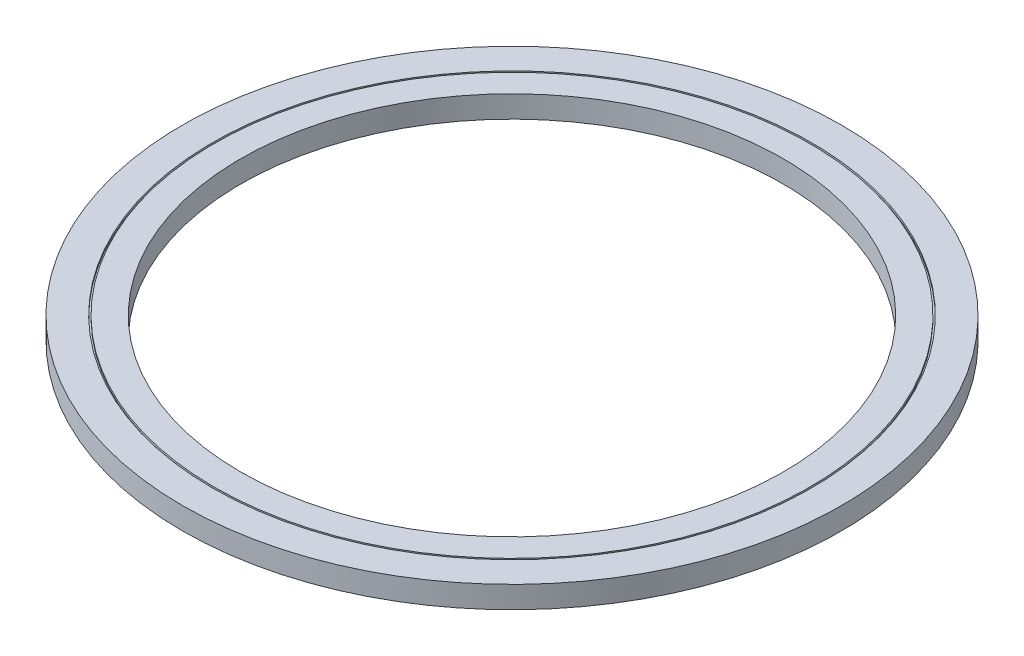
ISO-10303-21;
HEADER;
FILE_DESCRIPTION(('STEP AP214'),'2;1');
FILE_NAME('part.step','',(''),(''),'','','');
FILE_SCHEMA(('AUTOMOTIVE_DESIGN { 1 0 10303 214 1 1 1 1 }'));
ENDSEC;
DATA;
#1=APPLICATION_CONTEXT('core data for automotive mechanical design processes');
#2=APPLICATION_PROTOCOL_DEFINITION('international standard','automotive_design',2000,#1);
#3=PRODUCT_CONTEXT('',#1,'mechanical');
#4=PRODUCT('Part','Part','',(#3));
#5=PRODUCT_RELATED_PRODUCT_CATEGORY('part','',(#4));
#6=PRODUCT_DEFINITION_FORMATION('','',#4);
#7=PRODUCT_DEFINITION_CONTEXT('part definition',#1,'design');
#8=PRODUCT_DEFINITION('design','',#6,#7);
#9=PRODUCT_DEFINITION_SHAPE('','',#8);
#10=(LENGTH_UNIT() NAMED_UNIT(*) SI_UNIT(.MILLI.,.METRE.));
#11=(NAMED_UNIT(*) PLANE_ANGLE_UNIT() SI_UNIT($,.RADIAN.));
#12=(NAMED_UNIT(*) SI_UNIT($,.STERADIAN.) SOLID_ANGLE_UNIT());
#13=UNCERTAINTY_MEASURE_WITH_UNIT(LENGTH_MEASURE(1.E-05),#10,'distance_accuracy_value','');
#14=(GEOMETRIC_REPRESENTATION_CONTEXT(3) GLOBAL_UNCERTAINTY_ASSIGNED_CONTEXT((#13)) GLOBAL_UNIT_ASSIGNED_CONTEXT((#10,
#11,#12)) REPRESENTATION_CONTEXT('',''));
#15=CARTESIAN_POINT('',(0.,0.,0.));
#16=DIRECTION('',(0.,0.,1.));
#17=DIRECTION('',(1.,0.,0.));
#18=AXIS2_PLACEMENT_3D('',#15,#16,#17);
#19=CARTESIAN_POINT('',(0.,-5.,0.));
#20=DIRECTION('',(0.,1.,0.));
#21=DIRECTION('',(0.,0.,1.));
#22=AXIS2_PLACEMENT_3D('',#19,#20,#21);
#23=PLANE('',#22);
#24=CARTESIAN_POINT('',(0.,-5.,0.));
#25=DIRECTION('',(0.,1.,0.));
#26=DIRECTION('',(0.,0.,1.));
#27=AXIS2_PLACEMENT_3D('',#24,#25,#26);
#28=CIRCLE('',#27,123.5);
#29=CARTESIAN_POINT('',(0.,-5.,123.5));
#30=VERTEX_POINT('',#29);
#31=EDGE_CURVE('E58',#30,#30,#28,.T.);
#32=ORIENTED_EDGE('',*,*,#31,.T.);
#33=EDGE_LOOP('',(#32));
#34=FACE_BOUND('',#33,.T.);
#35=CARTESIAN_POINT('',(0.,-5.,0.));
#36=DIRECTION('',(0.,1.,0.));
#37=DIRECTION('',(0.,0.,1.));
#38=AXIS2_PLACEMENT_3D('',#35,#36,#37);
#39=CIRCLE('',#38,135.5);
#40=CARTESIAN_POINT('',(0.,-5.,135.5));
#41=VERTEX_POINT('',#40);
#42=EDGE_CURVE('E90',#41,#41,#39,.T.);
#43=ORIENTED_EDGE('',*,*,#42,.F.);
#44=EDGE_LOOP('',(#43));
#45=FACE_BOUND('',#44,.T.);
#46=ADVANCED_FACE('F43',(#34,#45),#23,.F.);
#47=CARTESIAN_POINT('',(0.,5.,0.));
#48=DIRECTION('',(0.,1.,0.));
#49=DIRECTION('',(0.,0.,1.));
#50=AXIS2_PLACEMENT_3D('',#47,#48,#49);
#51=PLANE('',#50);
#52=CARTESIAN_POINT('',(0.,5.,0.));
#53=DIRECTION('',(0.,1.,0.));
#54=DIRECTION('',(0.,0.,1.));
#55=AXIS2_PLACEMENT_3D('',#52,#53,#54);
#56=CIRCLE('',#55,123.5);
#57=CARTESIAN_POINT('',(0.,5.,123.5));
#58=VERTEX_POINT('',#57);
#59=EDGE_CURVE('E56',#58,#58,#56,.T.);
#60=ORIENTED_EDGE('',*,*,#59,.F.);
#61=EDGE_LOOP('',(#60));
#62=FACE_BOUND('',#61,.T.);
#63=CARTESIAN_POINT('',(0.,5.,0.));
#64=DIRECTION('',(0.,1.,0.));
#65=DIRECTION('',(0.,0.,1.));
#66=AXIS2_PLACEMENT_3D('',#63,#64,#65);
#67=CIRCLE('',#66,135.5);
#68=CARTESIAN_POINT('',(0.,5.,135.5));
#69=VERTEX_POINT('',#68);
#70=EDGE_CURVE('E74',#69,#69,#67,.T.);
#71=ORIENTED_EDGE('',*,*,#70,.T.);
#72=EDGE_LOOP('',(#71));
#73=FACE_BOUND('',#72,.T.);
#74=ADVANCED_FACE('F108',(#62,#73),#51,.T.);
#75=CARTESIAN_POINT('',(0.,5.,0.));
#76=DIRECTION('',(0.,1.,0.));
#77=DIRECTION('',(0.,0.,1.));
#78=AXIS2_PLACEMENT_3D('',#75,#76,#77);
#79=CIRCLE('',#78,136.25);
#80=CARTESIAN_POINT('',(0.,5.,136.25));
#81=VERTEX_POINT('',#80);
#82=EDGE_CURVE('E66',#81,#81,#79,.T.);
#83=ORIENTED_EDGE('',*,*,#82,.F.);
#84=EDGE_LOOP('',(#83));
#85=FACE_BOUND('',#84,.T.);
#86=CARTESIAN_POINT('',(0.,5.,0.));
#87=DIRECTION('',(0.,1.,0.));
#88=DIRECTION('',(0.,0.,1.));
#89=AXIS2_PLACEMENT_3D('',#86,#87,#88);
#90=CIRCLE('',#89,150.);
#91=CARTESIAN_POINT('',(0.,5.,150.));
#92=VERTEX_POINT('',#91);
#93=EDGE_CURVE('E10',#92,#92,#90,.T.);
#94=ORIENTED_EDGE('',*,*,#93,.T.);
#95=EDGE_LOOP('',(#94));
#96=FACE_BOUND('',#95,.T.);
#97=ADVANCED_FACE('F116',(#85,#96),#51,.T.);
#98=CARTESIAN_POINT('',(0.,-5.,0.));
#99=DIRECTION('',(0.,1.,0.));
#100=DIRECTION('',(0.,0.,1.));
#101=AXIS2_PLACEMENT_3D('',#98,#99,#100);
#102=CIRCLE('',#101,136.25);
#103=CARTESIAN_POINT('',(0.,-5.,136.25));
#104=VERTEX_POINT('',#103);
#105=EDGE_CURVE('E82',#104,#104,#102,.T.);
#106=ORIENTED_EDGE('',*,*,#105,.T.);
#107=EDGE_LOOP('',(#106));
#108=FACE_BOUND('',#107,.T.);
#109=CARTESIAN_POINT('',(0.,-5.,0.));
#110=DIRECTION('',(0.,1.,0.));
#111=DIRECTION('',(0.,0.,1.));
#112=AXIS2_PLACEMENT_3D('',#109,#110,#111);
#113=CIRCLE('',#112,150.);
#114=CARTESIAN_POINT('',(0.,-5.,150.));
#115=VERTEX_POINT('',#114);
#116=EDGE_CURVE('E47',#115,#115,#113,.T.);
#117=ORIENTED_EDGE('',*,*,#116,.F.);
#118=EDGE_LOOP('',(#117));
#119=FACE_BOUND('',#118,.T.);
#120=ADVANCED_FACE('F110',(#108,#119),#23,.F.);
#121=CARTESIAN_POINT('',(0.,5.,0.));
#122=DIRECTION('',(0.,-1.,0.));
#123=DIRECTION('',(0.,0.,-1.));
#124=AXIS2_PLACEMENT_3D('',#121,#122,#123);
#125=CYLINDRICAL_SURFACE('',#124,150.);
#126=ORIENTED_EDGE('',*,*,#93,.F.);
#127=EDGE_LOOP('',(#126));
#128=FACE_BOUND('',#127,.T.);
#129=ORIENTED_EDGE('',*,*,#116,.T.);
#130=EDGE_LOOP('',(#129));
#131=FACE_BOUND('',#130,.T.);
#132=ADVANCED_FACE('F45',(#128,#131),#125,.T.);
#133=CARTESIAN_POINT('',(0.,5.,0.));
#134=DIRECTION('',(0.,-1.,0.));
#135=DIRECTION('',(0.,0.,-1.));
#136=AXIS2_PLACEMENT_3D('',#133,#134,#135);
#137=CYLINDRICAL_SURFACE('',#136,123.5);
#138=ORIENTED_EDGE('',*,*,#59,.T.);
#139=EDGE_LOOP('',(#138));
#140=FACE_BOUND('',#139,.T.);
#141=ORIENTED_EDGE('',*,*,#31,.F.);
#142=EDGE_LOOP('',(#141));
#143=FACE_BOUND('',#142,.T.);
#144=ADVANCED_FACE('F124',(#140,#143),#137,.F.);
#145=CARTESIAN_POINT('',(0.,4.,0.));
#146=DIRECTION('',(0.,1.,0.));
#147=DIRECTION('',(0.,0.,1.));
#148=AXIS2_PLACEMENT_3D('',#145,#146,#147);
#149=CYLINDRICAL_SURFACE('',#148,136.25);
#150=CARTESIAN_POINT('',(0.,4.,0.));
#151=DIRECTION('',(0.,1.,0.));
#152=DIRECTION('',(0.,0.,1.));
#153=AXIS2_PLACEMENT_3D('',#150,#151,#152);
#154=CIRCLE('',#153,136.25);
#155=CARTESIAN_POINT('',(0.,4.,136.25));
#156=VERTEX_POINT('',#155);
#157=EDGE_CURVE('E62',#156,#156,#154,.T.);
#158=ORIENTED_EDGE('',*,*,#157,.F.);
#159=EDGE_LOOP('',(#158));
#160=FACE_BOUND('',#159,.T.);
#161=ORIENTED_EDGE('',*,*,#82,.T.);
#162=EDGE_LOOP('',(#161));
#163=FACE_BOUND('',#162,.T.);
#164=ADVANCED_FACE('F147',(#160,#163),#149,.F.);
#165=CARTESIAN_POINT('',(0.,4.,0.));
#166=DIRECTION('',(0.,1.,0.));
#167=DIRECTION('',(0.,0.,1.));
#168=AXIS2_PLACEMENT_3D('',#165,#166,#167);
#169=PLANE('',#168);
#170=CARTESIAN_POINT('',(0.,4.,0.));
#171=DIRECTION('',(0.,1.,0.));
#172=DIRECTION('',(0.,0.,1.));
#173=AXIS2_PLACEMENT_3D('',#170,#171,#172);
#174=CIRCLE('',#173,135.5);
#175=CARTESIAN_POINT('',(0.,4.,135.5));
#176=VERTEX_POINT('',#175);
#177=EDGE_CURVE('E70',#176,#176,#174,.T.);
#178=ORIENTED_EDGE('',*,*,#177,.F.);
#179=EDGE_LOOP('',(#178));
#180=FACE_BOUND('',#179,.T.);
#181=ORIENTED_EDGE('',*,*,#157,.T.);
#182=EDGE_LOOP('',(#181));
#183=FACE_BOUND('',#182,.T.);
#184=ADVANCED_FACE('F143',(#180,#183),#169,.T.);
#185=CARTESIAN_POINT('',(0.,4.,0.));
#186=DIRECTION('',(0.,1.,0.));
#187=DIRECTION('',(0.,0.,1.));
#188=AXIS2_PLACEMENT_3D('',#185,#186,#187);
#189=CYLINDRICAL_SURFACE('',#188,135.5);
#190=ORIENTED_EDGE('',*,*,#177,.T.);
#191=EDGE_LOOP('',(#190));
#192=FACE_BOUND('',#191,.T.);
#193=ORIENTED_EDGE('',*,*,#70,.F.);
#194=EDGE_LOOP('',(#193));
#195=FACE_BOUND('',#194,.T.);
#196=ADVANCED_FACE('F138',(#192,#195),#189,.T.);
#197=CARTESIAN_POINT('',(0.,-4.,0.));
#198=DIRECTION('',(0.,-1.,0.));
#199=DIRECTION('',(0.,0.,1.));
#200=AXIS2_PLACEMENT_3D('',#197,#198,#199);
#201=PLANE('',#200);
#202=CARTESIAN_POINT('',(0.,-4.,0.));
#203=DIRECTION('',(0.,1.,0.));
#204=DIRECTION('',(0.,0.,1.));
#205=AXIS2_PLACEMENT_3D('',#202,#203,#204);
#206=CIRCLE('',#205,136.25);
#207=CARTESIAN_POINT('',(0.,-4.,136.25));
#208=VERTEX_POINT('',#207);
#209=EDGE_CURVE('E78',#208,#208,#206,.T.);
#210=ORIENTED_EDGE('',*,*,#209,.F.);
#211=EDGE_LOOP('',(#210));
#212=FACE_BOUND('',#211,.T.);
#213=CARTESIAN_POINT('',(0.,-4.,0.));
#214=DIRECTION('',(0.,1.,0.));
#215=DIRECTION('',(0.,0.,1.));
#216=AXIS2_PLACEMENT_3D('',#213,#214,#215);
#217=CIRCLE('',#216,135.5);
#218=CARTESIAN_POINT('',(0.,-4.,135.5));
#219=VERTEX_POINT('',#218);
#220=EDGE_CURVE('E86',#219,#219,#217,.T.);
#221=ORIENTED_EDGE('',*,*,#220,.T.);
#222=EDGE_LOOP('',(#221));
#223=FACE_BOUND('',#222,.T.);
#224=ADVANCED_FACE('F98',(#212,#223),#201,.T.);
#225=CARTESIAN_POINT('',(0.,-4.,0.));
#226=DIRECTION('',(0.,-1.,0.));
#227=DIRECTION('',(0.,0.,-1.));
#228=AXIS2_PLACEMENT_3D('',#225,#226,#227);
#229=CYLINDRICAL_SURFACE('',#228,136.25);
#230=ORIENTED_EDGE('',*,*,#209,.T.);
#231=EDGE_LOOP('',(#230));
#232=FACE_BOUND('',#231,.T.);
#233=ORIENTED_EDGE('',*,*,#105,.F.);
#234=EDGE_LOOP('',(#233));
#235=FACE_BOUND('',#234,.T.);
#236=ADVANCED_FACE('F103',(#232,#235),#229,.F.);
#237=CARTESIAN_POINT('',(0.,-4.,0.));
#238=DIRECTION('',(0.,-1.,0.));
#239=DIRECTION('',(0.,0.,-1.));
#240=AXIS2_PLACEMENT_3D('',#237,#238,#239);
#241=CYLINDRICAL_SURFACE('',#240,135.5);
#242=ORIENTED_EDGE('',*,*,#220,.F.);
#243=EDGE_LOOP('',(#242));
#244=FACE_BOUND('',#243,.T.);
#245=ORIENTED_EDGE('',*,*,#42,.T.);
#246=EDGE_LOOP('',(#245));
#247=FACE_BOUND('',#246,.T.);
#248=ADVANCED_FACE('F100',(#244,#247),#241,.T.);
#249=CLOSED_SHELL('',(#46,#74,#97,#120,#132,#144,#164,#184,#196,#224,#236,#248));
#250=MANIFOLD_SOLID_BREP('B2',#249);
#251=ADVANCED_BREP_SHAPE_REPRESENTATION('',(#18,#250),#14);
#252=SHAPE_DEFINITION_REPRESENTATION(#9,#251);
ENDSEC;
END-ISO-10303-21;
